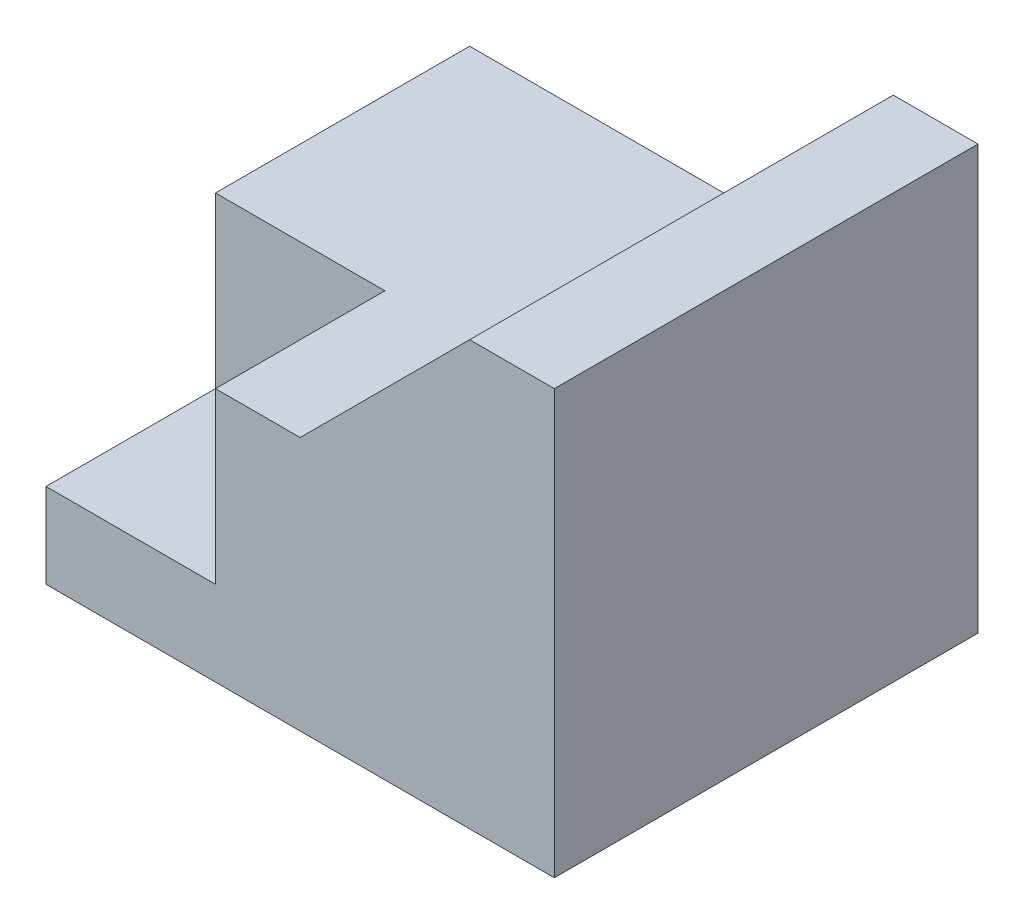
ISO-10303-21;
HEADER;
FILE_DESCRIPTION(('STEP AP214'),'2;1');
FILE_NAME('part.step','',(''),(''),'','','');
FILE_SCHEMA(('AUTOMOTIVE_DESIGN { 1 0 10303 214 1 1 1 1 }'));
ENDSEC;
DATA;
#1=APPLICATION_CONTEXT('core data for automotive mechanical design processes');
#2=APPLICATION_PROTOCOL_DEFINITION('international standard','automotive_design',2000,#1);
#3=PRODUCT_CONTEXT('',#1,'mechanical');
#4=PRODUCT('Part','Part','',(#3));
#5=PRODUCT_RELATED_PRODUCT_CATEGORY('part','',(#4));
#6=PRODUCT_DEFINITION_FORMATION('','',#4);
#7=PRODUCT_DEFINITION_CONTEXT('part definition',#1,'design');
#8=PRODUCT_DEFINITION('design','',#6,#7);
#9=PRODUCT_DEFINITION_SHAPE('','',#8);
#10=(LENGTH_UNIT() NAMED_UNIT(*) SI_UNIT(.MILLI.,.METRE.));
#11=(NAMED_UNIT(*) PLANE_ANGLE_UNIT() SI_UNIT($,.RADIAN.));
#12=(NAMED_UNIT(*) SI_UNIT($,.STERADIAN.) SOLID_ANGLE_UNIT());
#13=UNCERTAINTY_MEASURE_WITH_UNIT(LENGTH_MEASURE(1.E-05),#10,'distance_accuracy_value','');
#14=(GEOMETRIC_REPRESENTATION_CONTEXT(3) GLOBAL_UNCERTAINTY_ASSIGNED_CONTEXT((#13)) GLOBAL_UNIT_ASSIGNED_CONTEXT((#10,
#11,#12)) REPRESENTATION_CONTEXT('',''));
#15=CARTESIAN_POINT('',(0.,0.,0.));
#16=DIRECTION('',(0.,0.,1.));
#17=DIRECTION('',(1.,0.,0.));
#18=AXIS2_PLACEMENT_3D('',#15,#16,#17);
#19=CARTESIAN_POINT('',(60.,0.,50.));
#20=DIRECTION('',(0.,1.,0.));
#21=DIRECTION('',(0.,0.,1.));
#22=AXIS2_PLACEMENT_3D('',#19,#20,#21);
#23=PLANE('',#22);
#24=DIRECTION('',(1.,0.,0.));
#25=VECTOR('',#24,1.);
#26=CARTESIAN_POINT('',(60.,0.,0.));
#27=LINE('',#26,#25);
#28=CARTESIAN_POINT('',(0.,0.,0.));
#29=VERTEX_POINT('',#28);
#30=CARTESIAN_POINT('',(60.,0.,0.));
#31=VERTEX_POINT('',#30);
#32=EDGE_CURVE('E128',#29,#31,#27,.T.);
#33=ORIENTED_EDGE('',*,*,#32,.T.);
#34=DIRECTION('',(0.,0.,-1.));
#35=VECTOR('',#34,1.);
#36=CARTESIAN_POINT('',(60.,0.,50.));
#37=LINE('',#36,#35);
#38=CARTESIAN_POINT('',(60.,0.,50.));
#39=VERTEX_POINT('',#38);
#40=EDGE_CURVE('E11',#39,#31,#37,.T.);
#41=ORIENTED_EDGE('',*,*,#40,.F.);
#42=DIRECTION('',(1.,0.,0.));
#43=VECTOR('',#42,1.);
#44=CARTESIAN_POINT('',(60.,0.,50.));
#45=LINE('',#44,#43);
#46=CARTESIAN_POINT('',(0.,0.,50.));
#47=VERTEX_POINT('',#46);
#48=EDGE_CURVE('E141',#47,#39,#45,.T.);
#49=ORIENTED_EDGE('',*,*,#48,.F.);
#50=DIRECTION('',(0.,0.,-1.));
#51=VECTOR('',#50,1.);
#52=CARTESIAN_POINT('',(0.,0.,50.));
#53=LINE('',#52,#51);
#54=EDGE_CURVE('E127',#47,#29,#53,.T.);
#55=ORIENTED_EDGE('',*,*,#54,.T.);
#56=EDGE_LOOP('',(#33,#41,#49,#55));
#57=FACE_BOUND('',#56,.T.);
#58=ADVANCED_FACE('F35',(#57),#23,.F.);
#59=CARTESIAN_POINT('',(60.,50.,50.));
#60=DIRECTION('',(-1.,0.,0.));
#61=DIRECTION('',(0.,-1.,0.));
#62=AXIS2_PLACEMENT_3D('',#59,#60,#61);
#63=PLANE('',#62);
#64=DIRECTION('',(0.,1.,0.));
#65=VECTOR('',#64,1.);
#66=CARTESIAN_POINT('',(60.,50.,0.));
#67=LINE('',#66,#65);
#68=CARTESIAN_POINT('',(60.,50.,0.));
#69=VERTEX_POINT('',#68);
#70=EDGE_CURVE('E131',#31,#69,#67,.T.);
#71=ORIENTED_EDGE('',*,*,#70,.T.);
#72=DIRECTION('',(0.,0.,-1.));
#73=VECTOR('',#72,1.);
#74=CARTESIAN_POINT('',(60.,50.,50.));
#75=LINE('',#74,#73);
#76=CARTESIAN_POINT('',(60.,50.,50.));
#77=VERTEX_POINT('',#76);
#78=EDGE_CURVE('E42',#77,#69,#75,.T.);
#79=ORIENTED_EDGE('',*,*,#78,.F.);
#80=DIRECTION('',(0.,1.,0.));
#81=VECTOR('',#80,1.);
#82=CARTESIAN_POINT('',(60.,50.,50.));
#83=LINE('',#82,#81);
#84=EDGE_CURVE('E92',#39,#77,#83,.T.);
#85=ORIENTED_EDGE('',*,*,#84,.F.);
#86=ORIENTED_EDGE('',*,*,#40,.T.);
#87=EDGE_LOOP('',(#71,#79,#85,#86));
#88=FACE_BOUND('',#87,.T.);
#89=ADVANCED_FACE('F198',(#88),#63,.F.);
#90=CARTESIAN_POINT('',(50.,50.,50.));
#91=DIRECTION('',(0.,-1.,0.));
#92=DIRECTION('',(0.,0.,-1.));
#93=AXIS2_PLACEMENT_3D('',#90,#91,#92);
#94=PLANE('',#93);
#95=DIRECTION('',(-1.,0.,0.));
#96=VECTOR('',#95,1.);
#97=CARTESIAN_POINT('',(50.,50.,0.));
#98=LINE('',#97,#96);
#99=CARTESIAN_POINT('',(50.,50.,0.));
#100=VERTEX_POINT('',#99);
#101=EDGE_CURVE('E113',#69,#100,#98,.T.);
#102=ORIENTED_EDGE('',*,*,#101,.T.);
#103=DIRECTION('',(0.,0.,-1.));
#104=VECTOR('',#103,1.);
#105=CARTESIAN_POINT('',(50.,50.,50.));
#106=LINE('',#105,#104);
#107=CARTESIAN_POINT('',(50.,50.,50.));
#108=VERTEX_POINT('',#107);
#109=EDGE_CURVE('E110',#108,#100,#106,.T.);
#110=ORIENTED_EDGE('',*,*,#109,.F.);
#111=DIRECTION('',(-1.,0.,0.));
#112=VECTOR('',#111,1.);
#113=CARTESIAN_POINT('',(50.,50.,50.));
#114=LINE('',#113,#112);
#115=EDGE_CURVE('E99',#77,#108,#114,.T.);
#116=ORIENTED_EDGE('',*,*,#115,.F.);
#117=ORIENTED_EDGE('',*,*,#78,.T.);
#118=EDGE_LOOP('',(#102,#110,#116,#117));
#119=FACE_BOUND('',#118,.T.);
#120=ADVANCED_FACE('F111',(#119),#94,.F.);
#121=CARTESIAN_POINT('',(30.,30.,50.));
#122=DIRECTION('',(0.707106781186548,-0.707106781186547,0.));
#123=DIRECTION('',(0.707106781186547,0.707106781186548,0.));
#124=AXIS2_PLACEMENT_3D('',#121,#122,#123);
#125=PLANE('',#124);
#126=DIRECTION('',(-0.707106781186547,-0.707106781186548,0.));
#127=VECTOR('',#126,1.);
#128=CARTESIAN_POINT('',(30.,30.,0.));
#129=LINE('',#128,#127);
#130=CARTESIAN_POINT('',(30.,30.,0.));
#131=VERTEX_POINT('',#130);
#132=EDGE_CURVE('E135',#100,#131,#129,.T.);
#133=ORIENTED_EDGE('',*,*,#132,.T.);
#134=DIRECTION('',(0.,0.,-1.));
#135=VECTOR('',#134,1.);
#136=CARTESIAN_POINT('',(30.,30.,50.));
#137=LINE('',#136,#135);
#138=CARTESIAN_POINT('',(30.,30.,50.));
#139=VERTEX_POINT('',#138);
#140=EDGE_CURVE('E116',#139,#131,#137,.T.);
#141=ORIENTED_EDGE('',*,*,#140,.F.);
#142=DIRECTION('',(-0.707106781186547,-0.707106781186548,0.));
#143=VECTOR('',#142,1.);
#144=CARTESIAN_POINT('',(30.,30.,50.));
#145=LINE('',#144,#143);
#146=EDGE_CURVE('E104',#108,#139,#145,.T.);
#147=ORIENTED_EDGE('',*,*,#146,.F.);
#148=ORIENTED_EDGE('',*,*,#109,.T.);
#149=EDGE_LOOP('',(#133,#141,#147,#148));
#150=FACE_BOUND('',#149,.T.);
#151=ADVANCED_FACE('F118',(#150),#125,.F.);
#152=CARTESIAN_POINT('',(0.,30.,50.));
#153=DIRECTION('',(0.,-1.,0.));
#154=DIRECTION('',(0.,0.,-1.));
#155=AXIS2_PLACEMENT_3D('',#152,#153,#154);
#156=PLANE('',#155);
#157=DIRECTION('',(-1.,0.,0.));
#158=VECTOR('',#157,1.);
#159=CARTESIAN_POINT('',(0.,30.,30.));
#160=LINE('',#159,#158);
#161=CARTESIAN_POINT('',(20.,30.,30.));
#162=VERTEX_POINT('',#161);
#163=CARTESIAN_POINT('',(0.,30.,30.));
#164=VERTEX_POINT('',#163);
#165=EDGE_CURVE('E182',#162,#164,#160,.T.);
#166=ORIENTED_EDGE('',*,*,#165,.F.);
#167=DIRECTION('',(0.,0.,1.));
#168=VECTOR('',#167,1.);
#169=CARTESIAN_POINT('',(20.,30.,30.));
#170=LINE('',#169,#168);
#171=CARTESIAN_POINT('',(20.,30.,50.));
#172=VERTEX_POINT('',#171);
#173=EDGE_CURVE('E132',#162,#172,#170,.T.);
#174=ORIENTED_EDGE('',*,*,#173,.T.);
#175=DIRECTION('',(-1.,0.,0.));
#176=VECTOR('',#175,1.);
#177=CARTESIAN_POINT('',(0.,30.,50.));
#178=LINE('',#177,#176);
#179=EDGE_CURVE('E121',#139,#172,#178,.T.);
#180=ORIENTED_EDGE('',*,*,#179,.F.);
#181=ORIENTED_EDGE('',*,*,#140,.T.);
#182=DIRECTION('',(-1.,0.,0.));
#183=VECTOR('',#182,1.);
#184=CARTESIAN_POINT('',(0.,30.,0.));
#185=LINE('',#184,#183);
#186=CARTESIAN_POINT('',(0.,30.,0.));
#187=VERTEX_POINT('',#186);
#188=EDGE_CURVE('E137',#131,#187,#185,.T.);
#189=ORIENTED_EDGE('',*,*,#188,.T.);
#190=DIRECTION('',(0.,0.,-1.));
#191=VECTOR('',#190,1.);
#192=CARTESIAN_POINT('',(0.,30.,50.));
#193=LINE('',#192,#191);
#194=EDGE_CURVE('E143',#164,#187,#193,.T.);
#195=ORIENTED_EDGE('',*,*,#194,.F.);
#196=EDGE_LOOP('',(#166,#174,#180,#181,#189,#195));
#197=FACE_BOUND('',#196,.T.);
#198=ADVANCED_FACE('F151',(#197),#156,.F.);
#199=CARTESIAN_POINT('',(0.,0.,50.));
#200=DIRECTION('',(1.,0.,0.));
#201=DIRECTION('',(0.,0.,-1.));
#202=AXIS2_PLACEMENT_3D('',#199,#200,#201);
#203=PLANE('',#202);
#204=DIRECTION('',(0.,-1.,0.));
#205=VECTOR('',#204,1.);
#206=CARTESIAN_POINT('',(0.,0.,50.));
#207=LINE('',#206,#205);
#208=CARTESIAN_POINT('',(0.,10.,50.));
#209=VERTEX_POINT('',#208);
#210=EDGE_CURVE('E57',#209,#47,#207,.T.);
#211=ORIENTED_EDGE('',*,*,#210,.F.);
#212=DIRECTION('',(0.,0.,1.));
#213=VECTOR('',#212,1.);
#214=CARTESIAN_POINT('',(0.,10.,30.));
#215=LINE('',#214,#213);
#216=CARTESIAN_POINT('',(0.,10.,30.));
#217=VERTEX_POINT('',#216);
#218=EDGE_CURVE('E49',#217,#209,#215,.T.);
#219=ORIENTED_EDGE('',*,*,#218,.F.);
#220=DIRECTION('',(0.,-1.,0.));
#221=VECTOR('',#220,1.);
#222=CARTESIAN_POINT('',(0.,30.,30.));
#223=LINE('',#222,#221);
#224=EDGE_CURVE('E186',#164,#217,#223,.T.);
#225=ORIENTED_EDGE('',*,*,#224,.F.);
#226=ORIENTED_EDGE('',*,*,#194,.T.);
#227=DIRECTION('',(0.,-1.,0.));
#228=VECTOR('',#227,1.);
#229=CARTESIAN_POINT('',(0.,0.,0.));
#230=LINE('',#229,#228);
#231=EDGE_CURVE('E84',#187,#29,#230,.T.);
#232=ORIENTED_EDGE('',*,*,#231,.T.);
#233=ORIENTED_EDGE('',*,*,#54,.F.);
#234=EDGE_LOOP('',(#211,#219,#225,#226,#232,#233));
#235=FACE_BOUND('',#234,.T.);
#236=ADVANCED_FACE('F210',(#235),#203,.F.);
#237=CARTESIAN_POINT('',(0.,0.,50.));
#238=DIRECTION('',(0.,0.,-1.));
#239=DIRECTION('',(-1.,0.,0.));
#240=AXIS2_PLACEMENT_3D('',#237,#238,#239);
#241=PLANE('',#240);
#242=ORIENTED_EDGE('',*,*,#179,.T.);
#243=DIRECTION('',(0.,1.,0.));
#244=VECTOR('',#243,1.);
#245=CARTESIAN_POINT('',(20.,30.,50.));
#246=LINE('',#245,#244);
#247=CARTESIAN_POINT('',(20.,10.,50.));
#248=VERTEX_POINT('',#247);
#249=EDGE_CURVE('E158',#248,#172,#246,.T.);
#250=ORIENTED_EDGE('',*,*,#249,.F.);
#251=DIRECTION('',(1.,0.,0.));
#252=VECTOR('',#251,1.);
#253=CARTESIAN_POINT('',(0.,10.,50.));
#254=LINE('',#253,#252);
#255=EDGE_CURVE('E176',#209,#248,#254,.T.);
#256=ORIENTED_EDGE('',*,*,#255,.F.);
#257=ORIENTED_EDGE('',*,*,#210,.T.);
#258=ORIENTED_EDGE('',*,*,#48,.T.);
#259=ORIENTED_EDGE('',*,*,#84,.T.);
#260=ORIENTED_EDGE('',*,*,#115,.T.);
#261=ORIENTED_EDGE('',*,*,#146,.T.);
#262=EDGE_LOOP('',(#242,#250,#256,#257,#258,#259,#260,#261));
#263=FACE_BOUND('',#262,.T.);
#264=ADVANCED_FACE('F102',(#263),#241,.F.);
#265=CARTESIAN_POINT('',(0.,0.,0.));
#266=DIRECTION('',(0.,0.,-1.));
#267=DIRECTION('',(-1.,0.,0.));
#268=AXIS2_PLACEMENT_3D('',#265,#266,#267);
#269=PLANE('',#268);
#270=ORIENTED_EDGE('',*,*,#32,.F.);
#271=ORIENTED_EDGE('',*,*,#231,.F.);
#272=ORIENTED_EDGE('',*,*,#188,.F.);
#273=ORIENTED_EDGE('',*,*,#132,.F.);
#274=ORIENTED_EDGE('',*,*,#101,.F.);
#275=ORIENTED_EDGE('',*,*,#70,.F.);
#276=EDGE_LOOP('',(#270,#271,#272,#273,#274,#275));
#277=FACE_BOUND('',#276,.T.);
#278=ADVANCED_FACE('F147',(#277),#269,.T.);
#279=CARTESIAN_POINT('',(20.,30.,30.));
#280=DIRECTION('',(1.,0.,0.));
#281=DIRECTION('',(0.,1.,0.));
#282=AXIS2_PLACEMENT_3D('',#279,#280,#281);
#283=PLANE('',#282);
#284=ORIENTED_EDGE('',*,*,#249,.T.);
#285=ORIENTED_EDGE('',*,*,#173,.F.);
#286=DIRECTION('',(0.,1.,0.));
#287=VECTOR('',#286,1.);
#288=CARTESIAN_POINT('',(20.,30.,30.));
#289=LINE('',#288,#287);
#290=CARTESIAN_POINT('',(20.,10.,30.));
#291=VERTEX_POINT('',#290);
#292=EDGE_CURVE('E179',#291,#162,#289,.T.);
#293=ORIENTED_EDGE('',*,*,#292,.F.);
#294=DIRECTION('',(0.,0.,1.));
#295=VECTOR('',#294,1.);
#296=CARTESIAN_POINT('',(20.,10.,30.));
#297=LINE('',#296,#295);
#298=EDGE_CURVE('E166',#291,#248,#297,.T.);
#299=ORIENTED_EDGE('',*,*,#298,.T.);
#300=EDGE_LOOP('',(#284,#285,#293,#299));
#301=FACE_BOUND('',#300,.T.);
#302=ADVANCED_FACE('F180',(#301),#283,.F.);
#303=CARTESIAN_POINT('',(0.,10.,30.));
#304=DIRECTION('',(0.,-1.,0.));
#305=DIRECTION('',(0.,0.,-1.));
#306=AXIS2_PLACEMENT_3D('',#303,#304,#305);
#307=PLANE('',#306);
#308=ORIENTED_EDGE('',*,*,#255,.T.);
#309=ORIENTED_EDGE('',*,*,#298,.F.);
#310=DIRECTION('',(1.,0.,0.));
#311=VECTOR('',#310,1.);
#312=CARTESIAN_POINT('',(0.,10.,30.));
#313=LINE('',#312,#311);
#314=EDGE_CURVE('E174',#217,#291,#313,.T.);
#315=ORIENTED_EDGE('',*,*,#314,.F.);
#316=ORIENTED_EDGE('',*,*,#218,.T.);
#317=EDGE_LOOP('',(#308,#309,#315,#316));
#318=FACE_BOUND('',#317,.T.);
#319=ADVANCED_FACE('F172',(#318),#307,.F.);
#320=CARTESIAN_POINT('',(0.,0.,30.));
#321=DIRECTION('',(0.,0.,1.));
#322=DIRECTION('',(1.,0.,0.));
#323=AXIS2_PLACEMENT_3D('',#320,#321,#322);
#324=PLANE('',#323);
#325=ORIENTED_EDGE('',*,*,#224,.T.);
#326=ORIENTED_EDGE('',*,*,#314,.T.);
#327=ORIENTED_EDGE('',*,*,#292,.T.);
#328=ORIENTED_EDGE('',*,*,#165,.T.);
#329=EDGE_LOOP('',(#325,#326,#327,#328));
#330=FACE_BOUND('',#329,.T.);
#331=ADVANCED_FACE('F184',(#330),#324,.T.);
#332=CLOSED_SHELL('',(#58,#89,#120,#151,#198,#236,#264,#278,#302,#319,#331));
#333=MANIFOLD_SOLID_BREP('B2',#332);
#334=ADVANCED_BREP_SHAPE_REPRESENTATION('',(#18,#333),#14);
#335=SHAPE_DEFINITION_REPRESENTATION(#9,#334);
ENDSEC;
END-ISO-10303-21;
